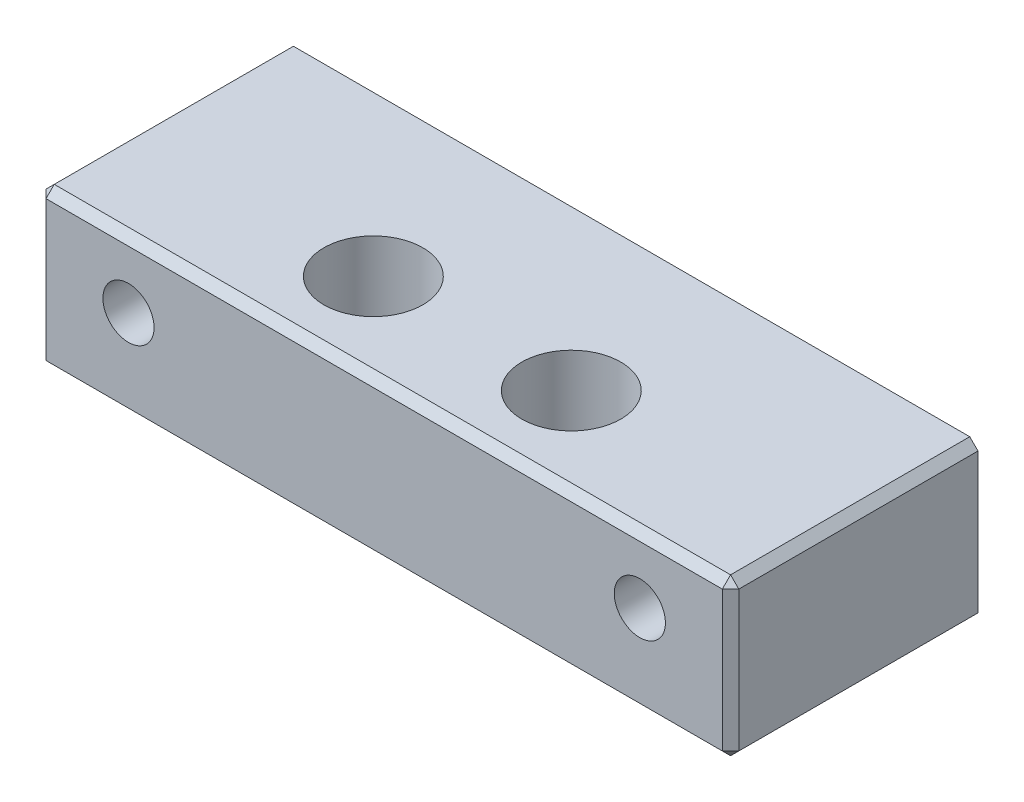
ISO-10303-21;
HEADER;
FILE_DESCRIPTION(('STEP AP214'),'2;1');
FILE_NAME('part.step','',(''),(''),'','','');
FILE_SCHEMA(('AUTOMOTIVE_DESIGN { 1 0 10303 214 1 1 1 1 }'));
ENDSEC;
DATA;
#1=APPLICATION_CONTEXT('core data for automotive mechanical design processes');
#2=APPLICATION_PROTOCOL_DEFINITION('international standard','automotive_design',2000,#1);
#3=PRODUCT_CONTEXT('',#1,'mechanical');
#4=PRODUCT('Part','Part','',(#3));
#5=PRODUCT_RELATED_PRODUCT_CATEGORY('part','',(#4));
#6=PRODUCT_DEFINITION_FORMATION('','',#4);
#7=PRODUCT_DEFINITION_CONTEXT('part definition',#1,'design');
#8=PRODUCT_DEFINITION('design','',#6,#7);
#9=PRODUCT_DEFINITION_SHAPE('','',#8);
#10=(LENGTH_UNIT() NAMED_UNIT(*) SI_UNIT(.MILLI.,.METRE.));
#11=(NAMED_UNIT(*) PLANE_ANGLE_UNIT() SI_UNIT($,.RADIAN.));
#12=(NAMED_UNIT(*) SI_UNIT($,.STERADIAN.) SOLID_ANGLE_UNIT());
#13=UNCERTAINTY_MEASURE_WITH_UNIT(LENGTH_MEASURE(1.E-05),#10,'distance_accuracy_value','');
#14=(GEOMETRIC_REPRESENTATION_CONTEXT(3) GLOBAL_UNCERTAINTY_ASSIGNED_CONTEXT((#13)) GLOBAL_UNIT_ASSIGNED_CONTEXT((#10,
#11,#12)) REPRESENTATION_CONTEXT('',''));
#15=CARTESIAN_POINT('',(0.,0.,0.));
#16=DIRECTION('',(0.,0.,1.));
#17=DIRECTION('',(1.,0.,0.));
#18=AXIS2_PLACEMENT_3D('',#15,#16,#17);
#19=CARTESIAN_POINT('',(21.,-4.75,7.5));
#20=DIRECTION('',(-1.,0.,0.));
#21=DIRECTION('',(0.,0.,1.));
#22=AXIS2_PLACEMENT_3D('',#19,#20,#21);
#23=PLANE('',#22);
#24=DIRECTION('',(0.,1.,0.));
#25=VECTOR('',#24,1.);
#26=CARTESIAN_POINT('',(21.,-4.75,-7.5));
#27=LINE('',#26,#25);
#28=CARTESIAN_POINT('',(21.,-4.25,-7.5));
#29=VERTEX_POINT('',#28);
#30=CARTESIAN_POINT('',(21.,4.24999999999999,-7.5));
#31=VERTEX_POINT('',#30);
#32=EDGE_CURVE('E141',#29,#31,#27,.T.);
#33=ORIENTED_EDGE('',*,*,#32,.T.);
#34=DIRECTION('',(0.,0.,1.));
#35=VECTOR('',#34,1.);
#36=CARTESIAN_POINT('',(21.,4.24999999999999,7.5));
#37=LINE('',#36,#35);
#38=CARTESIAN_POINT('',(21.,4.24999999999999,6.99999999999999));
#39=VERTEX_POINT('',#38);
#40=EDGE_CURVE('E118',#31,#39,#37,.T.);
#41=ORIENTED_EDGE('',*,*,#40,.T.);
#42=DIRECTION('',(0.,-1.,0.));
#43=VECTOR('',#42,1.);
#44=CARTESIAN_POINT('',(21.,-4.75,6.99999999999999));
#45=LINE('',#44,#43);
#46=CARTESIAN_POINT('',(21.,-4.25,6.99999999999999));
#47=VERTEX_POINT('',#46);
#48=EDGE_CURVE('E123',#39,#47,#45,.T.);
#49=ORIENTED_EDGE('',*,*,#48,.T.);
#50=DIRECTION('',(0.,0.,-1.));
#51=VECTOR('',#50,1.);
#52=CARTESIAN_POINT('',(21.,-4.25,7.5));
#53=LINE('',#52,#51);
#54=EDGE_CURVE('E158',#47,#29,#53,.T.);
#55=ORIENTED_EDGE('',*,*,#54,.T.);
#56=EDGE_LOOP('',(#33,#41,#49,#55));
#57=FACE_BOUND('',#56,.T.);
#58=ADVANCED_FACE('F32',(#57),#23,.F.);
#59=CARTESIAN_POINT('',(-21.,4.75,7.5));
#60=DIRECTION('',(0.,-1.,0.));
#61=DIRECTION('',(0.,0.,-1.));
#62=AXIS2_PLACEMENT_3D('',#59,#60,#61);
#63=PLANE('',#62);
#64=CARTESIAN_POINT('',(-6.,4.75,2.155));
#65=DIRECTION('',(0.,1.,0.));
#66=DIRECTION('',(0.,0.,1.));
#67=AXIS2_PLACEMENT_3D('',#64,#65,#66);
#68=CIRCLE('',#67,3.);
#69=CARTESIAN_POINT('',(-6.,4.75,5.155));
#70=VERTEX_POINT('',#69);
#71=EDGE_CURVE('E208',#70,#70,#68,.T.);
#72=ORIENTED_EDGE('',*,*,#71,.F.);
#73=EDGE_LOOP('',(#72));
#74=FACE_BOUND('',#73,.T.);
#75=CARTESIAN_POINT('',(6.,4.75,2.155));
#76=DIRECTION('',(0.,1.,0.));
#77=DIRECTION('',(0.,0.,1.));
#78=AXIS2_PLACEMENT_3D('',#75,#76,#77);
#79=CIRCLE('',#78,3.);
#80=CARTESIAN_POINT('',(6.,4.75,5.155));
#81=VERTEX_POINT('',#80);
#82=EDGE_CURVE('E218',#81,#81,#79,.T.);
#83=ORIENTED_EDGE('',*,*,#82,.F.);
#84=EDGE_LOOP('',(#83));
#85=FACE_BOUND('',#84,.T.);
#86=DIRECTION('',(1.,0.,0.));
#87=VECTOR('',#86,1.);
#88=CARTESIAN_POINT('',(-21.,4.75,6.99999999999999));
#89=LINE('',#88,#87);
#90=CARTESIAN_POINT('',(-20.5,4.75,6.99999999999999));
#91=VERTEX_POINT('',#90);
#92=CARTESIAN_POINT('',(20.5,4.75,6.99999999999999));
#93=VERTEX_POINT('',#92);
#94=EDGE_CURVE('E132',#91,#93,#89,.T.);
#95=ORIENTED_EDGE('',*,*,#94,.T.);
#96=DIRECTION('',(0.,0.,-1.));
#97=VECTOR('',#96,1.);
#98=CARTESIAN_POINT('',(20.5,4.75,7.5));
#99=LINE('',#98,#97);
#100=CARTESIAN_POINT('',(20.5,4.75,-7.5));
#101=VERTEX_POINT('',#100);
#102=EDGE_CURVE('E117',#93,#101,#99,.T.);
#103=ORIENTED_EDGE('',*,*,#102,.T.);
#104=DIRECTION('',(-1.,0.,0.));
#105=VECTOR('',#104,1.);
#106=CARTESIAN_POINT('',(-21.,4.75,-7.5));
#107=LINE('',#106,#105);
#108=CARTESIAN_POINT('',(-20.5,4.75,-7.5));
#109=VERTEX_POINT('',#108);
#110=EDGE_CURVE('E129',#101,#109,#107,.T.);
#111=ORIENTED_EDGE('',*,*,#110,.T.);
#112=DIRECTION('',(0.,0.,1.));
#113=VECTOR('',#112,1.);
#114=CARTESIAN_POINT('',(-20.5,4.75,7.5));
#115=LINE('',#114,#113);
#116=EDGE_CURVE('E134',#109,#91,#115,.T.);
#117=ORIENTED_EDGE('',*,*,#116,.T.);
#118=EDGE_LOOP('',(#95,#103,#111,#117));
#119=FACE_BOUND('',#118,.T.);
#120=ADVANCED_FACE('F128',(#74,#85,#119),#63,.F.);
#121=CARTESIAN_POINT('',(-21.,-4.75,7.5));
#122=DIRECTION('',(1.,0.,0.));
#123=DIRECTION('',(0.,0.,-1.));
#124=AXIS2_PLACEMENT_3D('',#121,#122,#123);
#125=PLANE('',#124);
#126=DIRECTION('',(0.,1.,0.));
#127=VECTOR('',#126,1.);
#128=CARTESIAN_POINT('',(-21.,-4.75,6.99999999999999));
#129=LINE('',#128,#127);
#130=CARTESIAN_POINT('',(-21.,-4.24999999999999,6.99999999999999));
#131=VERTEX_POINT('',#130);
#132=CARTESIAN_POINT('',(-21.,4.24999999999999,6.99999999999999));
#133=VERTEX_POINT('',#132);
#134=EDGE_CURVE('E167',#131,#133,#129,.T.);
#135=ORIENTED_EDGE('',*,*,#134,.T.);
#136=DIRECTION('',(0.,0.,-1.));
#137=VECTOR('',#136,1.);
#138=CARTESIAN_POINT('',(-21.,4.24999999999999,7.5));
#139=LINE('',#138,#137);
#140=CARTESIAN_POINT('',(-21.,4.25,-7.5));
#141=VERTEX_POINT('',#140);
#142=EDGE_CURVE('E171',#133,#141,#139,.T.);
#143=ORIENTED_EDGE('',*,*,#142,.T.);
#144=DIRECTION('',(0.,-1.,0.));
#145=VECTOR('',#144,1.);
#146=CARTESIAN_POINT('',(-21.,-4.75,-7.5));
#147=LINE('',#146,#145);
#148=CARTESIAN_POINT('',(-21.,-4.24999999999999,-7.5));
#149=VERTEX_POINT('',#148);
#150=EDGE_CURVE('E140',#141,#149,#147,.T.);
#151=ORIENTED_EDGE('',*,*,#150,.T.);
#152=DIRECTION('',(0.,0.,1.));
#153=VECTOR('',#152,1.);
#154=CARTESIAN_POINT('',(-21.,-4.24999999999999,7.5));
#155=LINE('',#154,#153);
#156=EDGE_CURVE('E169',#149,#131,#155,.T.);
#157=ORIENTED_EDGE('',*,*,#156,.T.);
#158=EDGE_LOOP('',(#135,#143,#151,#157));
#159=FACE_BOUND('',#158,.T.);
#160=ADVANCED_FACE('F249',(#159),#125,.F.);
#161=CARTESIAN_POINT('',(-21.,-4.75,7.5));
#162=DIRECTION('',(0.,1.,0.));
#163=DIRECTION('',(0.,0.,1.));
#164=AXIS2_PLACEMENT_3D('',#161,#162,#163);
#165=PLANE('',#164);
#166=DIRECTION('',(1.,0.,0.));
#167=VECTOR('',#166,1.);
#168=CARTESIAN_POINT('',(-21.,-4.75,-7.5));
#169=LINE('',#168,#167);
#170=CARTESIAN_POINT('',(-20.5,-4.75,-7.5));
#171=VERTEX_POINT('',#170);
#172=CARTESIAN_POINT('',(20.5,-4.75,-7.5));
#173=VERTEX_POINT('',#172);
#174=EDGE_CURVE('E144',#171,#173,#169,.T.);
#175=ORIENTED_EDGE('',*,*,#174,.T.);
#176=DIRECTION('',(0.,0.,1.));
#177=VECTOR('',#176,1.);
#178=CARTESIAN_POINT('',(20.5,-4.75,7.5));
#179=LINE('',#178,#177);
#180=CARTESIAN_POINT('',(20.5,-4.75,6.99999999999999));
#181=VERTEX_POINT('',#180);
#182=EDGE_CURVE('E165',#173,#181,#179,.T.);
#183=ORIENTED_EDGE('',*,*,#182,.T.);
#184=DIRECTION('',(-1.,0.,0.));
#185=VECTOR('',#184,1.);
#186=CARTESIAN_POINT('',(-21.,-4.75,6.99999999999999));
#187=LINE('',#186,#185);
#188=CARTESIAN_POINT('',(-20.5,-4.75,6.99999999999999));
#189=VERTEX_POINT('',#188);
#190=EDGE_CURVE('E161',#181,#189,#187,.T.);
#191=ORIENTED_EDGE('',*,*,#190,.T.);
#192=DIRECTION('',(0.,0.,-1.));
#193=VECTOR('',#192,1.);
#194=CARTESIAN_POINT('',(-20.5,-4.75,7.5));
#195=LINE('',#194,#193);
#196=EDGE_CURVE('E163',#189,#171,#195,.T.);
#197=ORIENTED_EDGE('',*,*,#196,.T.);
#198=EDGE_LOOP('',(#175,#183,#191,#197));
#199=FACE_BOUND('',#198,.T.);
#200=CARTESIAN_POINT('',(-6.,-4.75,2.155));
#201=DIRECTION('',(0.,1.,0.));
#202=DIRECTION('',(0.,0.,1.));
#203=AXIS2_PLACEMENT_3D('',#200,#201,#202);
#204=CIRCLE('',#203,3.);
#205=CARTESIAN_POINT('',(-6.,-4.75,5.155));
#206=VERTEX_POINT('',#205);
#207=EDGE_CURVE('E213',#206,#206,#204,.T.);
#208=ORIENTED_EDGE('',*,*,#207,.T.);
#209=EDGE_LOOP('',(#208));
#210=FACE_BOUND('',#209,.T.);
#211=CARTESIAN_POINT('',(6.,-4.75,2.155));
#212=DIRECTION('',(0.,1.,0.));
#213=DIRECTION('',(0.,0.,1.));
#214=AXIS2_PLACEMENT_3D('',#211,#212,#213);
#215=CIRCLE('',#214,3.);
#216=CARTESIAN_POINT('',(6.,-4.75,5.155));
#217=VERTEX_POINT('',#216);
#218=EDGE_CURVE('E221',#217,#217,#215,.T.);
#219=ORIENTED_EDGE('',*,*,#218,.T.);
#220=EDGE_LOOP('',(#219));
#221=FACE_BOUND('',#220,.T.);
#222=ADVANCED_FACE('F241',(#199,#210,#221),#165,.F.);
#223=CARTESIAN_POINT('',(21.,4.75,7.5));
#224=DIRECTION('',(0.,0.,-1.));
#225=DIRECTION('',(-1.,0.,0.));
#226=AXIS2_PLACEMENT_3D('',#223,#224,#225);
#227=PLANE('',#226);
#228=DIRECTION('',(1.,0.,0.));
#229=VECTOR('',#228,1.);
#230=CARTESIAN_POINT('',(21.,-4.25,7.5));
#231=LINE('',#230,#229);
#232=CARTESIAN_POINT('',(-20.5,-4.25,7.5));
#233=VERTEX_POINT('',#232);
#234=CARTESIAN_POINT('',(20.5,-4.25,7.5));
#235=VERTEX_POINT('',#234);
#236=EDGE_CURVE('E56',#233,#235,#231,.T.);
#237=ORIENTED_EDGE('',*,*,#236,.T.);
#238=DIRECTION('',(0.,1.,0.));
#239=VECTOR('',#238,1.);
#240=CARTESIAN_POINT('',(20.5,4.75,7.5));
#241=LINE('',#240,#239);
#242=CARTESIAN_POINT('',(20.5,4.25,7.5));
#243=VERTEX_POINT('',#242);
#244=EDGE_CURVE('E11',#235,#243,#241,.T.);
#245=ORIENTED_EDGE('',*,*,#244,.T.);
#246=DIRECTION('',(-1.,0.,0.));
#247=VECTOR('',#246,1.);
#248=CARTESIAN_POINT('',(21.,4.25,7.5));
#249=LINE('',#248,#247);
#250=CARTESIAN_POINT('',(-20.5,4.25,7.5));
#251=VERTEX_POINT('',#250);
#252=EDGE_CURVE('E41',#243,#251,#249,.T.);
#253=ORIENTED_EDGE('',*,*,#252,.T.);
#254=DIRECTION('',(0.,-1.,0.));
#255=VECTOR('',#254,1.);
#256=CARTESIAN_POINT('',(-20.5,4.75,7.5));
#257=LINE('',#256,#255);
#258=EDGE_CURVE('E173',#251,#233,#257,.T.);
#259=ORIENTED_EDGE('',*,*,#258,.T.);
#260=EDGE_LOOP('',(#237,#245,#253,#259));
#261=FACE_BOUND('',#260,.T.);
#262=CARTESIAN_POINT('',(15.5,0.750000000000005,7.5));
#263=DIRECTION('',(0.,0.,1.));
#264=DIRECTION('',(1.,0.,0.));
#265=AXIS2_PLACEMENT_3D('',#262,#263,#264);
#266=CIRCLE('',#265,1.55);
#267=CARTESIAN_POINT('',(17.05,0.750000000000005,7.5));
#268=VERTEX_POINT('',#267);
#269=EDGE_CURVE('E224',#268,#268,#266,.T.);
#270=ORIENTED_EDGE('',*,*,#269,.F.);
#271=EDGE_LOOP('',(#270));
#272=FACE_BOUND('',#271,.T.);
#273=CARTESIAN_POINT('',(-15.5,0.750000000000002,7.5));
#274=DIRECTION('',(0.,0.,1.));
#275=DIRECTION('',(1.,0.,0.));
#276=AXIS2_PLACEMENT_3D('',#273,#274,#275);
#277=CIRCLE('',#276,1.55);
#278=CARTESIAN_POINT('',(-13.95,0.750000000000002,7.5));
#279=VERTEX_POINT('',#278);
#280=EDGE_CURVE('E230',#279,#279,#277,.T.);
#281=ORIENTED_EDGE('',*,*,#280,.F.);
#282=EDGE_LOOP('',(#281));
#283=FACE_BOUND('',#282,.T.);
#284=ADVANCED_FACE('F239',(#261,#272,#283),#227,.F.);
#285=CARTESIAN_POINT('',(21.,4.75,-7.5));
#286=DIRECTION('',(0.,0.,-1.));
#287=DIRECTION('',(-1.,0.,0.));
#288=AXIS2_PLACEMENT_3D('',#285,#286,#287);
#289=PLANE('',#288);
#290=CARTESIAN_POINT('',(15.5,0.750000000000005,-7.5));
#291=DIRECTION('',(0.,0.,1.));
#292=DIRECTION('',(1.,0.,0.));
#293=AXIS2_PLACEMENT_3D('',#290,#291,#292);
#294=CIRCLE('',#293,1.55);
#295=CARTESIAN_POINT('',(17.05,0.750000000000005,-7.5));
#296=VERTEX_POINT('',#295);
#297=EDGE_CURVE('E227',#296,#296,#294,.T.);
#298=ORIENTED_EDGE('',*,*,#297,.T.);
#299=EDGE_LOOP('',(#298));
#300=FACE_BOUND('',#299,.T.);
#301=CARTESIAN_POINT('',(-15.5,0.750000000000002,-7.5));
#302=DIRECTION('',(0.,0.,1.));
#303=DIRECTION('',(1.,0.,0.));
#304=AXIS2_PLACEMENT_3D('',#301,#302,#303);
#305=CIRCLE('',#304,1.55);
#306=CARTESIAN_POINT('',(-13.95,0.750000000000002,-7.5));
#307=VERTEX_POINT('',#306);
#308=EDGE_CURVE('E146',#307,#307,#305,.T.);
#309=ORIENTED_EDGE('',*,*,#308,.T.);
#310=EDGE_LOOP('',(#309));
#311=FACE_BOUND('',#310,.T.);
#312=ORIENTED_EDGE('',*,*,#110,.F.);
#313=DIRECTION('',(-0.707106781186543,0.707106781186552,0.));
#314=VECTOR('',#313,1.);
#315=CARTESIAN_POINT('',(20.75,4.50000000000001,-7.5));
#316=LINE('',#315,#314);
#317=EDGE_CURVE('E113',#101,#31,#316,.F.);
#318=ORIENTED_EDGE('',*,*,#317,.T.);
#319=ORIENTED_EDGE('',*,*,#32,.F.);
#320=DIRECTION('',(0.707106781186552,0.707106781186543,0.));
#321=VECTOR('',#320,1.);
#322=CARTESIAN_POINT('',(25.5,0.249999999999932,-7.5));
#323=LINE('',#322,#321);
#324=EDGE_CURVE('E124',#29,#173,#323,.F.);
#325=ORIENTED_EDGE('',*,*,#324,.T.);
#326=ORIENTED_EDGE('',*,*,#174,.F.);
#327=DIRECTION('',(0.707106781186543,-0.707106781186552,0.));
#328=VECTOR('',#327,1.);
#329=CARTESIAN_POINT('',(-4.50000000000029,-20.7499999999999,-7.5));
#330=LINE('',#329,#328);
#331=EDGE_CURVE('E133',#171,#149,#330,.F.);
#332=ORIENTED_EDGE('',*,*,#331,.T.);
#333=ORIENTED_EDGE('',*,*,#150,.F.);
#334=DIRECTION('',(-0.707106781186543,-0.707106781186552,0.));
#335=VECTOR('',#334,1.);
#336=CARTESIAN_POINT('',(0.249999999999705,25.5,-7.5));
#337=LINE('',#336,#335);
#338=EDGE_CURVE('E139',#141,#109,#337,.F.);
#339=ORIENTED_EDGE('',*,*,#338,.T.);
#340=EDGE_LOOP('',(#312,#318,#319,#325,#326,#332,#333,#339));
#341=FACE_BOUND('',#340,.T.);
#342=ADVANCED_FACE('F136',(#300,#311,#341),#289,.T.);
#343=CARTESIAN_POINT('',(-15.5,0.750000000000002,-7.5));
#344=DIRECTION('',(0.,0.,1.));
#345=DIRECTION('',(1.,0.,0.));
#346=AXIS2_PLACEMENT_3D('',#343,#344,#345);
#347=CYLINDRICAL_SURFACE('',#346,1.55);
#348=ORIENTED_EDGE('',*,*,#308,.F.);
#349=EDGE_LOOP('',(#348));
#350=FACE_BOUND('',#349,.T.);
#351=ORIENTED_EDGE('',*,*,#280,.T.);
#352=EDGE_LOOP('',(#351));
#353=FACE_BOUND('',#352,.T.);
#354=ADVANCED_FACE('F237',(#350,#353),#347,.F.);
#355=CARTESIAN_POINT('',(15.5,0.750000000000005,-7.5));
#356=DIRECTION('',(0.,0.,1.));
#357=DIRECTION('',(1.,0.,0.));
#358=AXIS2_PLACEMENT_3D('',#355,#356,#357);
#359=CYLINDRICAL_SURFACE('',#358,1.55);
#360=ORIENTED_EDGE('',*,*,#297,.F.);
#361=EDGE_LOOP('',(#360));
#362=FACE_BOUND('',#361,.T.);
#363=ORIENTED_EDGE('',*,*,#269,.T.);
#364=EDGE_LOOP('',(#363));
#365=FACE_BOUND('',#364,.T.);
#366=ADVANCED_FACE('F333',(#362,#365),#359,.F.);
#367=CARTESIAN_POINT('',(6.,-4.75,2.155));
#368=DIRECTION('',(0.,1.,0.));
#369=DIRECTION('',(0.,0.,1.));
#370=AXIS2_PLACEMENT_3D('',#367,#368,#369);
#371=CYLINDRICAL_SURFACE('',#370,3.);
#372=ORIENTED_EDGE('',*,*,#218,.F.);
#373=EDGE_LOOP('',(#372));
#374=FACE_BOUND('',#373,.T.);
#375=ORIENTED_EDGE('',*,*,#82,.T.);
#376=EDGE_LOOP('',(#375));
#377=FACE_BOUND('',#376,.T.);
#378=ADVANCED_FACE('F330',(#374,#377),#371,.F.);
#379=CARTESIAN_POINT('',(-6.,-4.75,2.155));
#380=DIRECTION('',(0.,1.,0.));
#381=DIRECTION('',(0.,0.,1.));
#382=AXIS2_PLACEMENT_3D('',#379,#380,#381);
#383=CYLINDRICAL_SURFACE('',#382,3.);
#384=ORIENTED_EDGE('',*,*,#207,.F.);
#385=EDGE_LOOP('',(#384));
#386=FACE_BOUND('',#385,.T.);
#387=ORIENTED_EDGE('',*,*,#71,.T.);
#388=EDGE_LOOP('',(#387));
#389=FACE_BOUND('',#388,.T.);
#390=ADVANCED_FACE('F304',(#386,#389),#383,.F.);
#391=CARTESIAN_POINT('',(-20.5,-4.75,7.5));
#392=DIRECTION('',(0.707106781186552,0.707106781186542,0.));
#393=DIRECTION('',(-0.707106781186543,0.707106781186552,0.));
#394=AXIS2_PLACEMENT_3D('',#391,#392,#393);
#395=PLANE('',#394);
#396=DIRECTION('',(-0.707106781186543,0.707106781186552,0.));
#397=VECTOR('',#396,1.);
#398=CARTESIAN_POINT('',(-21.,-4.24999999999999,6.99999999999999));
#399=LINE('',#398,#397);
#400=EDGE_CURVE('E36',#131,#189,#399,.F.);
#401=ORIENTED_EDGE('',*,*,#400,.F.);
#402=ORIENTED_EDGE('',*,*,#156,.F.);
#403=ORIENTED_EDGE('',*,*,#331,.F.);
#404=ORIENTED_EDGE('',*,*,#196,.F.);
#405=EDGE_LOOP('',(#401,#402,#403,#404));
#406=FACE_BOUND('',#405,.T.);
#407=ADVANCED_FACE('F34',(#406),#395,.F.);
#408=CARTESIAN_POINT('',(-21.,-4.24999999999999,6.99999999999999));
#409=DIRECTION('',(-0.577350269189634,-0.577350269189626,0.577350269189618));
#410=DIRECTION('',(0.707106781186543,-0.707106781186552,0.));
#411=AXIS2_PLACEMENT_3D('',#408,#409,#410);
#412=PLANE('',#411);
#413=DIRECTION('',(0.707106781186543,0.,0.707106781186552));
#414=VECTOR('',#413,1.);
#415=CARTESIAN_POINT('',(-21.,-4.24999999999999,6.99999999999999));
#416=LINE('',#415,#414);
#417=EDGE_CURVE('E200',#131,#233,#416,.T.);
#418=ORIENTED_EDGE('',*,*,#417,.F.);
#419=ORIENTED_EDGE('',*,*,#400,.T.);
#420=DIRECTION('',(0.,-0.707106781186543,-0.707106781186552));
#421=VECTOR('',#420,1.);
#422=CARTESIAN_POINT('',(-20.5,-4.5,7.25));
#423=LINE('',#422,#421);
#424=EDGE_CURVE('E202',#233,#189,#423,.T.);
#425=ORIENTED_EDGE('',*,*,#424,.F.);
#426=EDGE_LOOP('',(#418,#419,#425));
#427=FACE_BOUND('',#426,.T.);
#428=ADVANCED_FACE('F298',(#427),#412,.T.);
#429=CARTESIAN_POINT('',(21.,-4.25,7.5));
#430=DIRECTION('',(-0.707106781186542,0.707106781186552,0.));
#431=DIRECTION('',(-0.707106781186552,-0.707106781186543,0.));
#432=AXIS2_PLACEMENT_3D('',#429,#430,#431);
#433=PLANE('',#432);
#434=ORIENTED_EDGE('',*,*,#324,.F.);
#435=ORIENTED_EDGE('',*,*,#54,.F.);
#436=DIRECTION('',(-0.707106781186552,-0.707106781186543,0.));
#437=VECTOR('',#436,1.);
#438=CARTESIAN_POINT('',(20.5,-4.75,6.99999999999999));
#439=LINE('',#438,#437);
#440=EDGE_CURVE('E197',#181,#47,#439,.F.);
#441=ORIENTED_EDGE('',*,*,#440,.F.);
#442=ORIENTED_EDGE('',*,*,#182,.F.);
#443=EDGE_LOOP('',(#434,#435,#441,#442));
#444=FACE_BOUND('',#443,.T.);
#445=ADVANCED_FACE('F296',(#444),#433,.F.);
#446=CARTESIAN_POINT('',(21.,-4.25,7.5));
#447=DIRECTION('',(0.,0.707106781186552,-0.707106781186542));
#448=DIRECTION('',(0.,0.707106781186543,0.707106781186552));
#449=AXIS2_PLACEMENT_3D('',#446,#447,#448);
#450=PLANE('',#449);
#451=ORIENTED_EDGE('',*,*,#424,.T.);
#452=ORIENTED_EDGE('',*,*,#190,.F.);
#453=DIRECTION('',(0.,0.707106781186543,0.707106781186552));
#454=VECTOR('',#453,1.);
#455=CARTESIAN_POINT('',(20.5,-4.75,6.99999999999999));
#456=LINE('',#455,#454);
#457=EDGE_CURVE('E194',#235,#181,#456,.F.);
#458=ORIENTED_EDGE('',*,*,#457,.F.);
#459=ORIENTED_EDGE('',*,*,#236,.F.);
#460=EDGE_LOOP('',(#451,#452,#458,#459));
#461=FACE_BOUND('',#460,.T.);
#462=ADVANCED_FACE('F292',(#461),#450,.F.);
#463=CARTESIAN_POINT('',(-20.5,4.75,7.5));
#464=DIRECTION('',(0.707106781186552,0.,-0.707106781186542));
#465=DIRECTION('',(-0.707106781186543,0.,-0.707106781186552));
#466=AXIS2_PLACEMENT_3D('',#463,#464,#465);
#467=PLANE('',#466);
#468=ORIENTED_EDGE('',*,*,#417,.T.);
#469=ORIENTED_EDGE('',*,*,#258,.F.);
#470=DIRECTION('',(-0.707106781186543,0.,-0.707106781186552));
#471=VECTOR('',#470,1.);
#472=CARTESIAN_POINT('',(-20.75,4.25,7.25));
#473=LINE('',#472,#471);
#474=EDGE_CURVE('E191',#133,#251,#473,.F.);
#475=ORIENTED_EDGE('',*,*,#474,.F.);
#476=ORIENTED_EDGE('',*,*,#134,.F.);
#477=EDGE_LOOP('',(#468,#469,#475,#476));
#478=FACE_BOUND('',#477,.T.);
#479=ADVANCED_FACE('F288',(#478),#467,.F.);
#480=CARTESIAN_POINT('',(-21.,4.24999999999999,7.5));
#481=DIRECTION('',(0.707106781186552,-0.707106781186542,0.));
#482=DIRECTION('',(0.707106781186543,0.707106781186552,0.));
#483=AXIS2_PLACEMENT_3D('',#480,#481,#482);
#484=PLANE('',#483);
#485=ORIENTED_EDGE('',*,*,#338,.F.);
#486=ORIENTED_EDGE('',*,*,#142,.F.);
#487=DIRECTION('',(0.707106781186543,0.707106781186552,0.));
#488=VECTOR('',#487,1.);
#489=CARTESIAN_POINT('',(-20.5,4.75,6.99999999999999));
#490=LINE('',#489,#488);
#491=EDGE_CURVE('E188',#91,#133,#490,.F.);
#492=ORIENTED_EDGE('',*,*,#491,.F.);
#493=ORIENTED_EDGE('',*,*,#116,.F.);
#494=EDGE_LOOP('',(#485,#486,#492,#493));
#495=FACE_BOUND('',#494,.T.);
#496=ADVANCED_FACE('F284',(#495),#484,.F.);
#497=CARTESIAN_POINT('',(20.5,-4.75,6.99999999999999));
#498=DIRECTION('',(0.577350269189626,-0.577350269189634,0.577350269189618));
#499=DIRECTION('',(0.707106781186552,0.707106781186543,0.));
#500=AXIS2_PLACEMENT_3D('',#497,#498,#499);
#501=PLANE('',#500);
#502=ORIENTED_EDGE('',*,*,#457,.T.);
#503=ORIENTED_EDGE('',*,*,#440,.T.);
#504=DIRECTION('',(0.707106781186543,0.,-0.707106781186552));
#505=VECTOR('',#504,1.);
#506=CARTESIAN_POINT('',(20.75,-4.25,7.25));
#507=LINE('',#506,#505);
#508=EDGE_CURVE('E185',#235,#47,#507,.T.);
#509=ORIENTED_EDGE('',*,*,#508,.F.);
#510=EDGE_LOOP('',(#502,#503,#509));
#511=FACE_BOUND('',#510,.T.);
#512=ADVANCED_FACE('F280',(#511),#501,.T.);
#513=CARTESIAN_POINT('',(-20.5,4.75,6.99999999999999));
#514=DIRECTION('',(-0.577350269189634,0.577350269189626,0.577350269189618));
#515=DIRECTION('',(-0.707106781186543,-0.707106781186552,0.));
#516=AXIS2_PLACEMENT_3D('',#513,#514,#515);
#517=PLANE('',#516);
#518=ORIENTED_EDGE('',*,*,#491,.T.);
#519=ORIENTED_EDGE('',*,*,#474,.T.);
#520=DIRECTION('',(0.,-0.707106781186543,0.707106781186552));
#521=VECTOR('',#520,1.);
#522=CARTESIAN_POINT('',(-20.5,4.75,6.99999999999999));
#523=LINE('',#522,#521);
#524=EDGE_CURVE('E182',#91,#251,#523,.T.);
#525=ORIENTED_EDGE('',*,*,#524,.F.);
#526=EDGE_LOOP('',(#518,#519,#525));
#527=FACE_BOUND('',#526,.T.);
#528=ADVANCED_FACE('F276',(#527),#517,.T.);
#529=CARTESIAN_POINT('',(20.5,4.75,7.5));
#530=DIRECTION('',(-0.707106781186552,0.,-0.707106781186542));
#531=DIRECTION('',(-0.707106781186543,0.,0.707106781186552));
#532=AXIS2_PLACEMENT_3D('',#529,#530,#531);
#533=PLANE('',#532);
#534=ORIENTED_EDGE('',*,*,#508,.T.);
#535=ORIENTED_EDGE('',*,*,#48,.F.);
#536=DIRECTION('',(-0.707106781186543,0.,0.707106781186552));
#537=VECTOR('',#536,1.);
#538=CARTESIAN_POINT('',(21.,4.24999999999999,6.99999999999999));
#539=LINE('',#538,#537);
#540=EDGE_CURVE('E180',#243,#39,#539,.F.);
#541=ORIENTED_EDGE('',*,*,#540,.F.);
#542=ORIENTED_EDGE('',*,*,#244,.F.);
#543=EDGE_LOOP('',(#534,#535,#541,#542));
#544=FACE_BOUND('',#543,.T.);
#545=ADVANCED_FACE('F272',(#544),#533,.F.);
#546=CARTESIAN_POINT('',(21.,4.25,7.5));
#547=DIRECTION('',(0.,-0.707106781186552,-0.707106781186542));
#548=DIRECTION('',(0.,0.707106781186543,-0.707106781186552));
#549=AXIS2_PLACEMENT_3D('',#546,#547,#548);
#550=PLANE('',#549);
#551=ORIENTED_EDGE('',*,*,#524,.T.);
#552=ORIENTED_EDGE('',*,*,#252,.F.);
#553=DIRECTION('',(0.,0.707106781186543,-0.707106781186552));
#554=VECTOR('',#553,1.);
#555=CARTESIAN_POINT('',(20.5,4.5,7.25));
#556=LINE('',#555,#554);
#557=EDGE_CURVE('E49',#93,#243,#556,.F.);
#558=ORIENTED_EDGE('',*,*,#557,.F.);
#559=ORIENTED_EDGE('',*,*,#94,.F.);
#560=EDGE_LOOP('',(#551,#552,#558,#559));
#561=FACE_BOUND('',#560,.T.);
#562=ADVANCED_FACE('F269',(#561),#550,.F.);
#563=CARTESIAN_POINT('',(21.,4.24999999999999,6.99999999999999));
#564=DIRECTION('',(0.577350269189634,0.577350269189626,0.577350269189618));
#565=DIRECTION('',(-0.707106781186543,0.707106781186552,0.));
#566=AXIS2_PLACEMENT_3D('',#563,#564,#565);
#567=PLANE('',#566);
#568=ORIENTED_EDGE('',*,*,#557,.T.);
#569=ORIENTED_EDGE('',*,*,#540,.T.);
#570=DIRECTION('',(0.707106781186543,-0.707106781186552,0.));
#571=VECTOR('',#570,1.);
#572=CARTESIAN_POINT('',(21.,4.24999999999999,6.99999999999999));
#573=LINE('',#572,#571);
#574=EDGE_CURVE('E177',#93,#39,#573,.T.);
#575=ORIENTED_EDGE('',*,*,#574,.F.);
#576=EDGE_LOOP('',(#568,#569,#575));
#577=FACE_BOUND('',#576,.T.);
#578=ADVANCED_FACE('F266',(#577),#567,.T.);
#579=CARTESIAN_POINT('',(20.5,4.75,7.5));
#580=DIRECTION('',(-0.707106781186552,-0.707106781186542,0.));
#581=DIRECTION('',(0.707106781186543,-0.707106781186552,0.));
#582=AXIS2_PLACEMENT_3D('',#579,#580,#581);
#583=PLANE('',#582);
#584=ORIENTED_EDGE('',*,*,#574,.T.);
#585=ORIENTED_EDGE('',*,*,#40,.F.);
#586=ORIENTED_EDGE('',*,*,#317,.F.);
#587=ORIENTED_EDGE('',*,*,#102,.F.);
#588=EDGE_LOOP('',(#584,#585,#586,#587));
#589=FACE_BOUND('',#588,.T.);
#590=ADVANCED_FACE('F116',(#589),#583,.F.);
#591=CLOSED_SHELL('',(#58,#120,#160,#222,#284,#342,#354,#366,#378,#390,#407,#428,#445,#462,#479,
#496,#512,#528,#545,#562,#578,#590));
#592=MANIFOLD_SOLID_BREP('B2',#591);
#593=ADVANCED_BREP_SHAPE_REPRESENTATION('',(#18,#592),#14);
#594=SHAPE_DEFINITION_REPRESENTATION(#9,#593);
ENDSEC;
END-ISO-10303-21;
